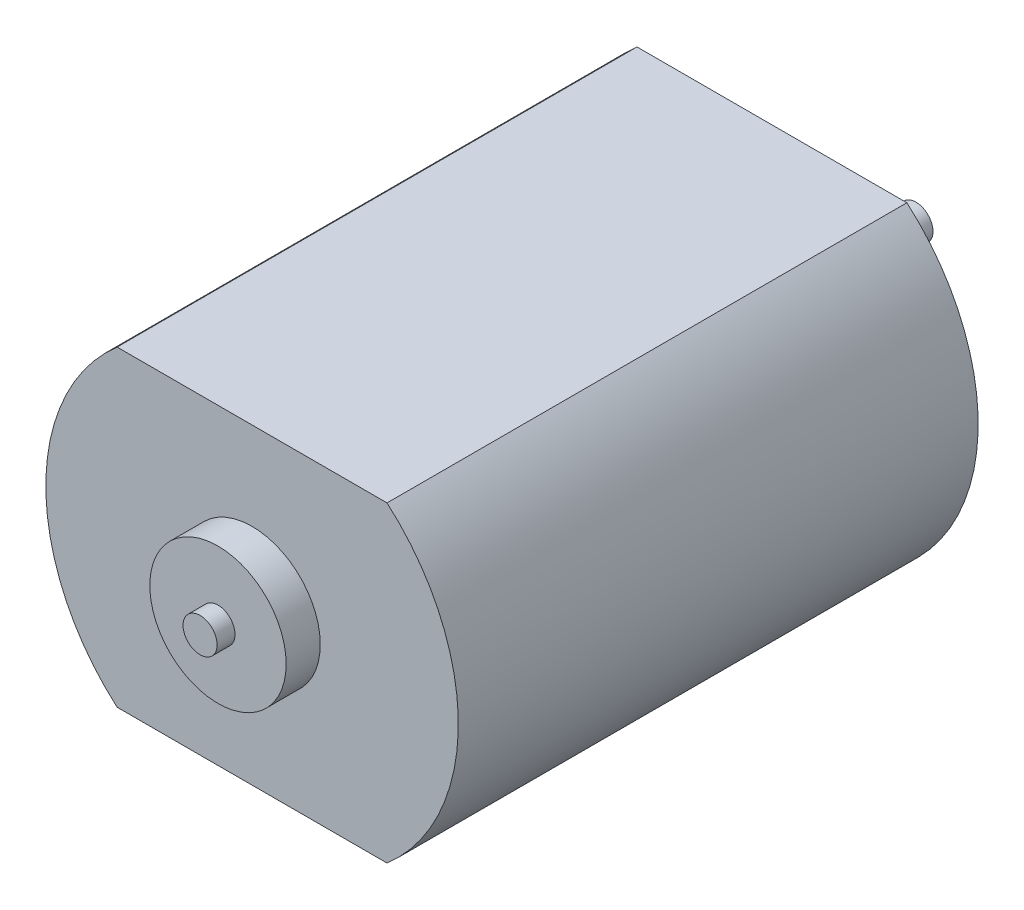
ISO-10303-21;
HEADER;
FILE_DESCRIPTION(('STEP AP214'),'2;1');
FILE_NAME('part.step','',(''),(''),'','','');
FILE_SCHEMA(('AUTOMOTIVE_DESIGN { 1 0 10303 214 1 1 1 1 }'));
ENDSEC;
DATA;
#1=APPLICATION_CONTEXT('core data for automotive mechanical design processes');
#2=APPLICATION_PROTOCOL_DEFINITION('international standard','automotive_design',2000,#1);
#3=PRODUCT_CONTEXT('',#1,'mechanical');
#4=PRODUCT('Part','Part','',(#3));
#5=PRODUCT_RELATED_PRODUCT_CATEGORY('part','',(#4));
#6=PRODUCT_DEFINITION_FORMATION('','',#4);
#7=PRODUCT_DEFINITION_CONTEXT('part definition',#1,'design');
#8=PRODUCT_DEFINITION('design','',#6,#7);
#9=PRODUCT_DEFINITION_SHAPE('','',#8);
#10=(LENGTH_UNIT() NAMED_UNIT(*) SI_UNIT(.MILLI.,.METRE.));
#11=(NAMED_UNIT(*) PLANE_ANGLE_UNIT() SI_UNIT($,.RADIAN.));
#12=(NAMED_UNIT(*) SI_UNIT($,.STERADIAN.) SOLID_ANGLE_UNIT());
#13=UNCERTAINTY_MEASURE_WITH_UNIT(LENGTH_MEASURE(1.E-05),#10,'distance_accuracy_value','');
#14=(GEOMETRIC_REPRESENTATION_CONTEXT(3) GLOBAL_UNCERTAINTY_ASSIGNED_CONTEXT((#13)) GLOBAL_UNIT_ASSIGNED_CONTEXT((#10,
#11,#12)) REPRESENTATION_CONTEXT('',''));
#15=CARTESIAN_POINT('',(0.,0.,0.));
#16=DIRECTION('',(0.,0.,1.));
#17=DIRECTION('',(1.,0.,0.));
#18=AXIS2_PLACEMENT_3D('',#15,#16,#17);
#19=CARTESIAN_POINT('',(0.,0.,30.5));
#20=DIRECTION('',(0.,0.,-1.));
#21=DIRECTION('',(-1.,0.,0.));
#22=AXIS2_PLACEMENT_3D('',#19,#20,#21);
#23=CYLINDRICAL_SURFACE('',#22,12.1);
#24=CARTESIAN_POINT('',(0.,0.,0.));
#25=DIRECTION('',(0.,0.,1.));
#26=DIRECTION('',(1.,0.,0.));
#27=AXIS2_PLACEMENT_3D('',#24,#25,#26);
#28=CIRCLE('',#27,12.1);
#29=CARTESIAN_POINT('',(7.91754381105656,-9.15,0.));
#30=VERTEX_POINT('',#29);
#31=CARTESIAN_POINT('',(7.91754381105656,9.15,0.));
#32=VERTEX_POINT('',#31);
#33=EDGE_CURVE('E101',#30,#32,#28,.T.);
#34=ORIENTED_EDGE('',*,*,#33,.T.);
#35=DIRECTION('',(0.,0.,-1.));
#36=VECTOR('',#35,1.);
#37=CARTESIAN_POINT('',(7.91754381105656,9.15,30.5));
#38=LINE('',#37,#36);
#39=CARTESIAN_POINT('',(7.91754381105656,9.15,30.5));
#40=VERTEX_POINT('',#39);
#41=EDGE_CURVE('E37',#40,#32,#38,.T.);
#42=ORIENTED_EDGE('',*,*,#41,.F.);
#43=CARTESIAN_POINT('',(0.,0.,30.5));
#44=DIRECTION('',(0.,0.,1.));
#45=DIRECTION('',(1.,0.,0.));
#46=AXIS2_PLACEMENT_3D('',#43,#44,#45);
#47=CIRCLE('',#46,12.1);
#48=CARTESIAN_POINT('',(7.91754381105656,-9.15,30.5));
#49=VERTEX_POINT('',#48);
#50=EDGE_CURVE('E88',#49,#40,#47,.T.);
#51=ORIENTED_EDGE('',*,*,#50,.F.);
#52=DIRECTION('',(0.,0.,-1.));
#53=VECTOR('',#52,1.);
#54=CARTESIAN_POINT('',(7.91754381105656,-9.15,30.5));
#55=LINE('',#54,#53);
#56=EDGE_CURVE('E97',#49,#30,#55,.T.);
#57=ORIENTED_EDGE('',*,*,#56,.T.);
#58=EDGE_LOOP('',(#34,#42,#51,#57));
#59=FACE_BOUND('',#58,.T.);
#60=ADVANCED_FACE('F34',(#59),#23,.T.);
#61=CARTESIAN_POINT('',(-7.91754381105656,9.15,30.5));
#62=DIRECTION('',(0.,-1.,0.));
#63=DIRECTION('',(0.,0.,-1.));
#64=AXIS2_PLACEMENT_3D('',#61,#62,#63);
#65=PLANE('',#64);
#66=DIRECTION('',(-1.,0.,0.));
#67=VECTOR('',#66,1.);
#68=CARTESIAN_POINT('',(-7.91754381105656,9.15,0.));
#69=LINE('',#68,#67);
#70=CARTESIAN_POINT('',(-7.91754381105656,9.15,0.));
#71=VERTEX_POINT('',#70);
#72=EDGE_CURVE('E93',#32,#71,#69,.T.);
#73=ORIENTED_EDGE('',*,*,#72,.T.);
#74=DIRECTION('',(0.,0.,-1.));
#75=VECTOR('',#74,1.);
#76=CARTESIAN_POINT('',(-7.91754381105656,9.15,30.5));
#77=LINE('',#76,#75);
#78=CARTESIAN_POINT('',(-7.91754381105656,9.15,30.5));
#79=VERTEX_POINT('',#78);
#80=EDGE_CURVE('E91',#79,#71,#77,.T.);
#81=ORIENTED_EDGE('',*,*,#80,.F.);
#82=DIRECTION('',(-1.,0.,0.));
#83=VECTOR('',#82,1.);
#84=CARTESIAN_POINT('',(-7.91754381105656,9.15,30.5));
#85=LINE('',#84,#83);
#86=EDGE_CURVE('E83',#40,#79,#85,.T.);
#87=ORIENTED_EDGE('',*,*,#86,.F.);
#88=ORIENTED_EDGE('',*,*,#41,.T.);
#89=EDGE_LOOP('',(#73,#81,#87,#88));
#90=FACE_BOUND('',#89,.T.);
#91=ADVANCED_FACE('F92',(#90),#65,.F.);
#92=CARTESIAN_POINT('',(0.,0.,30.5));
#93=DIRECTION('',(0.,0.,-1.));
#94=DIRECTION('',(-1.,0.,0.));
#95=AXIS2_PLACEMENT_3D('',#92,#93,#94);
#96=CYLINDRICAL_SURFACE('',#95,12.1);
#97=CARTESIAN_POINT('',(0.,0.,0.));
#98=DIRECTION('',(0.,0.,1.));
#99=DIRECTION('',(1.,0.,0.));
#100=AXIS2_PLACEMENT_3D('',#97,#98,#99);
#101=CIRCLE('',#100,12.1);
#102=CARTESIAN_POINT('',(-7.91754381105656,-9.15,0.));
#103=VERTEX_POINT('',#102);
#104=EDGE_CURVE('E69',#71,#103,#101,.T.);
#105=ORIENTED_EDGE('',*,*,#104,.T.);
#106=DIRECTION('',(0.,0.,-1.));
#107=VECTOR('',#106,1.);
#108=CARTESIAN_POINT('',(-7.91754381105656,-9.15,30.5));
#109=LINE('',#108,#107);
#110=CARTESIAN_POINT('',(-7.91754381105656,-9.15,30.5));
#111=VERTEX_POINT('',#110);
#112=EDGE_CURVE('E94',#111,#103,#109,.T.);
#113=ORIENTED_EDGE('',*,*,#112,.F.);
#114=CARTESIAN_POINT('',(0.,0.,30.5));
#115=DIRECTION('',(0.,0.,1.));
#116=DIRECTION('',(1.,0.,0.));
#117=AXIS2_PLACEMENT_3D('',#114,#115,#116);
#118=CIRCLE('',#117,12.1);
#119=EDGE_CURVE('E86',#79,#111,#118,.T.);
#120=ORIENTED_EDGE('',*,*,#119,.F.);
#121=ORIENTED_EDGE('',*,*,#80,.T.);
#122=EDGE_LOOP('',(#105,#113,#120,#121));
#123=FACE_BOUND('',#122,.T.);
#124=ADVANCED_FACE('F95',(#123),#96,.T.);
#125=CARTESIAN_POINT('',(-7.91754381105656,-9.15,30.5));
#126=DIRECTION('',(0.,1.,0.));
#127=DIRECTION('',(0.,0.,1.));
#128=AXIS2_PLACEMENT_3D('',#125,#126,#127);
#129=PLANE('',#128);
#130=DIRECTION('',(1.,0.,0.));
#131=VECTOR('',#130,1.);
#132=CARTESIAN_POINT('',(-7.91754381105656,-9.15,0.));
#133=LINE('',#132,#131);
#134=EDGE_CURVE('E75',#103,#30,#133,.T.);
#135=ORIENTED_EDGE('',*,*,#134,.T.);
#136=ORIENTED_EDGE('',*,*,#56,.F.);
#137=DIRECTION('',(1.,0.,0.));
#138=VECTOR('',#137,1.);
#139=CARTESIAN_POINT('',(-7.91754381105656,-9.15,30.5));
#140=LINE('',#139,#138);
#141=EDGE_CURVE('E52',#111,#49,#140,.T.);
#142=ORIENTED_EDGE('',*,*,#141,.F.);
#143=ORIENTED_EDGE('',*,*,#112,.T.);
#144=EDGE_LOOP('',(#135,#136,#142,#143));
#145=FACE_BOUND('',#144,.T.);
#146=ADVANCED_FACE('F109',(#145),#129,.F.);
#147=CARTESIAN_POINT('',(0.,0.,30.5));
#148=DIRECTION('',(0.,0.,1.));
#149=DIRECTION('',(1.,0.,0.));
#150=AXIS2_PLACEMENT_3D('',#147,#148,#149);
#151=PLANE('',#150);
#152=CARTESIAN_POINT('',(0.,0.,30.5));
#153=DIRECTION('',(0.,0.,1.));
#154=DIRECTION('',(1.,0.,0.));
#155=AXIS2_PLACEMENT_3D('',#152,#153,#154);
#156=CIRCLE('',#155,4.);
#157=CARTESIAN_POINT('',(4.,0.,30.5));
#158=VERTEX_POINT('',#157);
#159=EDGE_CURVE('E43',#158,#158,#156,.T.);
#160=ORIENTED_EDGE('',*,*,#159,.F.);
#161=EDGE_LOOP('',(#160));
#162=FACE_BOUND('',#161,.T.);
#163=ORIENTED_EDGE('',*,*,#50,.T.);
#164=ORIENTED_EDGE('',*,*,#86,.T.);
#165=ORIENTED_EDGE('',*,*,#119,.T.);
#166=ORIENTED_EDGE('',*,*,#141,.T.);
#167=EDGE_LOOP('',(#163,#164,#165,#166));
#168=FACE_BOUND('',#167,.T.);
#169=ADVANCED_FACE('F84',(#162,#168),#151,.T.);
#170=CARTESIAN_POINT('',(0.,0.,0.));
#171=DIRECTION('',(0.,0.,1.));
#172=DIRECTION('',(1.,0.,0.));
#173=AXIS2_PLACEMENT_3D('',#170,#171,#172);
#174=PLANE('',#173);
#175=CARTESIAN_POINT('',(0.,0.,0.));
#176=DIRECTION('',(0.,0.,-1.));
#177=DIRECTION('',(-1.,0.,0.));
#178=AXIS2_PLACEMENT_3D('',#175,#176,#177);
#179=CIRCLE('',#178,3.075);
#180=CARTESIAN_POINT('',(-3.075,0.,0.));
#181=VERTEX_POINT('',#180);
#182=EDGE_CURVE('E115',#181,#181,#179,.T.);
#183=ORIENTED_EDGE('',*,*,#182,.F.);
#184=EDGE_LOOP('',(#183));
#185=FACE_BOUND('',#184,.T.);
#186=ORIENTED_EDGE('',*,*,#33,.F.);
#187=ORIENTED_EDGE('',*,*,#134,.F.);
#188=ORIENTED_EDGE('',*,*,#104,.F.);
#189=ORIENTED_EDGE('',*,*,#72,.F.);
#190=EDGE_LOOP('',(#186,#187,#188,#189));
#191=FACE_BOUND('',#190,.T.);
#192=ADVANCED_FACE('F112',(#185,#191),#174,.F.);
#193=CARTESIAN_POINT('',(0.,0.,-1.6));
#194=DIRECTION('',(0.,0.,1.));
#195=DIRECTION('',(1.,0.,0.));
#196=AXIS2_PLACEMENT_3D('',#193,#194,#195);
#197=CYLINDRICAL_SURFACE('',#196,3.075);
#198=CARTESIAN_POINT('',(0.,0.,-1.6));
#199=DIRECTION('',(0.,0.,-1.));
#200=DIRECTION('',(-1.,0.,0.));
#201=AXIS2_PLACEMENT_3D('',#198,#199,#200);
#202=CIRCLE('',#201,3.075);
#203=CARTESIAN_POINT('',(-3.075,0.,-1.6));
#204=VERTEX_POINT('',#203);
#205=EDGE_CURVE('E104',#204,#204,#202,.T.);
#206=ORIENTED_EDGE('',*,*,#205,.F.);
#207=EDGE_LOOP('',(#206));
#208=FACE_BOUND('',#207,.T.);
#209=ORIENTED_EDGE('',*,*,#182,.T.);
#210=EDGE_LOOP('',(#209));
#211=FACE_BOUND('',#210,.T.);
#212=ADVANCED_FACE('F162',(#208,#211),#197,.T.);
#213=CARTESIAN_POINT('',(0.,0.,-1.6));
#214=DIRECTION('',(0.,0.,-1.));
#215=DIRECTION('',(-1.,0.,0.));
#216=AXIS2_PLACEMENT_3D('',#213,#214,#215);
#217=PLANE('',#216);
#218=CARTESIAN_POINT('',(0.,0.,-1.6));
#219=DIRECTION('',(0.,0.,-1.));
#220=DIRECTION('',(-1.,0.,0.));
#221=AXIS2_PLACEMENT_3D('',#218,#219,#220);
#222=CIRCLE('',#221,1.);
#223=CARTESIAN_POINT('',(-1.,0.,-1.6));
#224=VERTEX_POINT('',#223);
#225=EDGE_CURVE('E118',#224,#224,#222,.T.);
#226=ORIENTED_EDGE('',*,*,#225,.F.);
#227=EDGE_LOOP('',(#226));
#228=FACE_BOUND('',#227,.T.);
#229=ORIENTED_EDGE('',*,*,#205,.T.);
#230=EDGE_LOOP('',(#229));
#231=FACE_BOUND('',#230,.T.);
#232=ADVANCED_FACE('F197',(#228,#231),#217,.T.);
#233=CARTESIAN_POINT('',(0.,0.,-8.45));
#234=DIRECTION('',(0.,0.,1.));
#235=DIRECTION('',(1.,0.,0.));
#236=AXIS2_PLACEMENT_3D('',#233,#234,#235);
#237=CYLINDRICAL_SURFACE('',#236,1.);
#238=CARTESIAN_POINT('',(0.,0.,-8.45));
#239=DIRECTION('',(0.,0.,-1.));
#240=DIRECTION('',(-1.,0.,0.));
#241=AXIS2_PLACEMENT_3D('',#238,#239,#240);
#242=CIRCLE('',#241,1.);
#243=CARTESIAN_POINT('',(-1.,0.,-8.45));
#244=VERTEX_POINT('',#243);
#245=EDGE_CURVE('E121',#244,#244,#242,.T.);
#246=ORIENTED_EDGE('',*,*,#245,.F.);
#247=EDGE_LOOP('',(#246));
#248=FACE_BOUND('',#247,.T.);
#249=ORIENTED_EDGE('',*,*,#225,.T.);
#250=EDGE_LOOP('',(#249));
#251=FACE_BOUND('',#250,.T.);
#252=ADVANCED_FACE('F206',(#248,#251),#237,.T.);
#253=CARTESIAN_POINT('',(0.,0.,-8.45));
#254=DIRECTION('',(0.,0.,-1.));
#255=DIRECTION('',(-1.,0.,0.));
#256=AXIS2_PLACEMENT_3D('',#253,#254,#255);
#257=PLANE('',#256);
#258=ORIENTED_EDGE('',*,*,#245,.T.);
#259=EDGE_LOOP('',(#258));
#260=FACE_BOUND('',#259,.T.);
#261=ADVANCED_FACE('F152',(#260),#257,.T.);
#262=CARTESIAN_POINT('',(0.,0.,32.5));
#263=DIRECTION('',(0.,0.,-1.));
#264=DIRECTION('',(-1.,0.,0.));
#265=AXIS2_PLACEMENT_3D('',#262,#263,#264);
#266=CYLINDRICAL_SURFACE('',#265,4.);
#267=CARTESIAN_POINT('',(0.,0.,32.5));
#268=DIRECTION('',(0.,0.,1.));
#269=DIRECTION('',(1.,0.,0.));
#270=AXIS2_PLACEMENT_3D('',#267,#268,#269);
#271=CIRCLE('',#270,4.);
#272=CARTESIAN_POINT('',(4.,0.,32.5));
#273=VERTEX_POINT('',#272);
#274=EDGE_CURVE('E126',#273,#273,#271,.T.);
#275=ORIENTED_EDGE('',*,*,#274,.F.);
#276=EDGE_LOOP('',(#275));
#277=FACE_BOUND('',#276,.T.);
#278=ORIENTED_EDGE('',*,*,#159,.T.);
#279=EDGE_LOOP('',(#278));
#280=FACE_BOUND('',#279,.T.);
#281=ADVANCED_FACE('F146',(#277,#280),#266,.T.);
#282=CARTESIAN_POINT('',(0.,0.,32.5));
#283=DIRECTION('',(0.,0.,1.));
#284=DIRECTION('',(1.,0.,0.));
#285=AXIS2_PLACEMENT_3D('',#282,#283,#284);
#286=PLANE('',#285);
#287=CARTESIAN_POINT('',(0.,0.,32.5));
#288=DIRECTION('',(0.,0.,1.));
#289=DIRECTION('',(1.,0.,0.));
#290=AXIS2_PLACEMENT_3D('',#287,#288,#289);
#291=CIRCLE('',#290,1.);
#292=CARTESIAN_POINT('',(1.,0.,32.5));
#293=VERTEX_POINT('',#292);
#294=EDGE_CURVE('E11',#293,#293,#291,.T.);
#295=ORIENTED_EDGE('',*,*,#294,.F.);
#296=EDGE_LOOP('',(#295));
#297=FACE_BOUND('',#296,.T.);
#298=ORIENTED_EDGE('',*,*,#274,.T.);
#299=EDGE_LOOP('',(#298));
#300=FACE_BOUND('',#299,.T.);
#301=ADVANCED_FACE('F140',(#297,#300),#286,.T.);
#302=CARTESIAN_POINT('',(0.,0.,33.55));
#303=DIRECTION('',(0.,0.,-1.));
#304=DIRECTION('',(-1.,0.,0.));
#305=AXIS2_PLACEMENT_3D('',#302,#303,#304);
#306=CYLINDRICAL_SURFACE('',#305,1.);
#307=CARTESIAN_POINT('',(0.,0.,33.55));
#308=DIRECTION('',(0.,0.,1.));
#309=DIRECTION('',(1.,0.,0.));
#310=AXIS2_PLACEMENT_3D('',#307,#308,#309);
#311=CIRCLE('',#310,1.);
#312=CARTESIAN_POINT('',(1.,0.,33.55));
#313=VERTEX_POINT('',#312);
#314=EDGE_CURVE('E130',#313,#313,#311,.T.);
#315=ORIENTED_EDGE('',*,*,#314,.F.);
#316=EDGE_LOOP('',(#315));
#317=FACE_BOUND('',#316,.T.);
#318=ORIENTED_EDGE('',*,*,#294,.T.);
#319=EDGE_LOOP('',(#318));
#320=FACE_BOUND('',#319,.T.);
#321=ADVANCED_FACE('F137',(#317,#320),#306,.T.);
#322=CARTESIAN_POINT('',(0.,0.,33.55));
#323=DIRECTION('',(0.,0.,1.));
#324=DIRECTION('',(1.,0.,0.));
#325=AXIS2_PLACEMENT_3D('',#322,#323,#324);
#326=PLANE('',#325);
#327=ORIENTED_EDGE('',*,*,#314,.T.);
#328=EDGE_LOOP('',(#327));
#329=FACE_BOUND('',#328,.T.);
#330=ADVANCED_FACE('F135',(#329),#326,.T.);
#331=CLOSED_SHELL('',(#60,#91,#124,#146,#169,#192,#212,#232,#252,#261,#281,#301,#321,#330));
#332=MANIFOLD_SOLID_BREP('B2',#331);
#333=ADVANCED_BREP_SHAPE_REPRESENTATION('',(#18,#332),#14);
#334=SHAPE_DEFINITION_REPRESENTATION(#9,#333);
ENDSEC;
END-ISO-10303-21;
